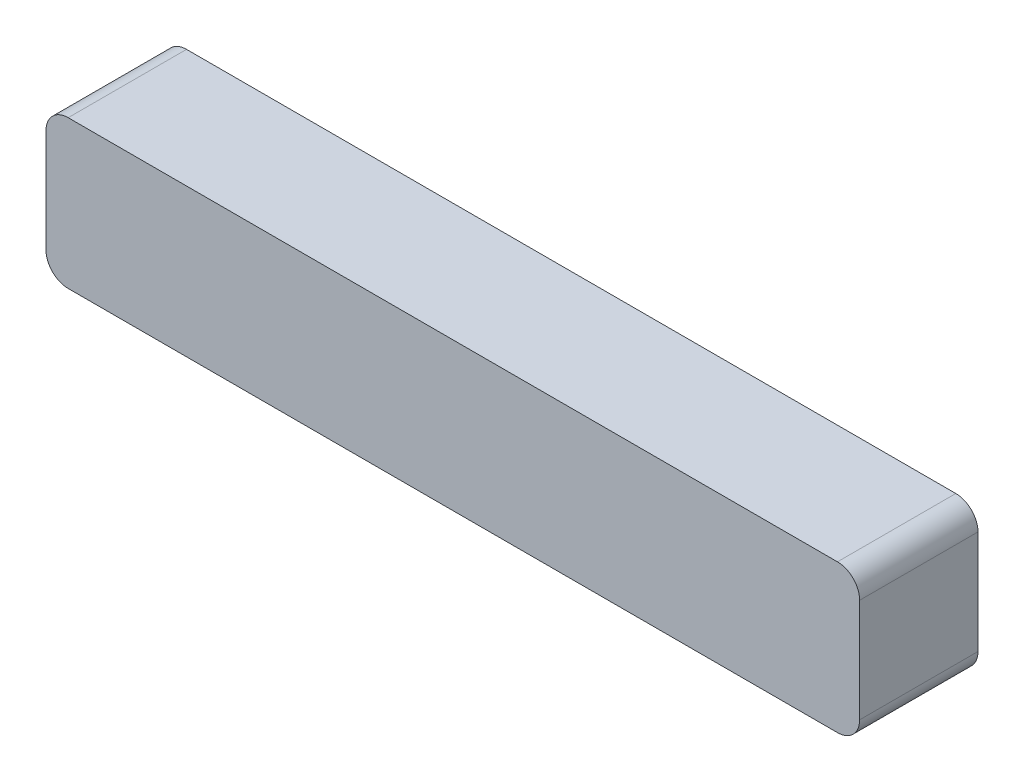
ISO-10303-21;
HEADER;
FILE_DESCRIPTION(('STEP AP214'),'2;1');
FILE_NAME('part.step','',(''),(''),'','','');
FILE_SCHEMA(('AUTOMOTIVE_DESIGN { 1 0 10303 214 1 1 1 1 }'));
ENDSEC;
DATA;
#1=APPLICATION_CONTEXT('core data for automotive mechanical design processes');
#2=APPLICATION_PROTOCOL_DEFINITION('international standard','automotive_design',2000,#1);
#3=PRODUCT_CONTEXT('',#1,'mechanical');
#4=PRODUCT('Part','Part','',(#3));
#5=PRODUCT_RELATED_PRODUCT_CATEGORY('part','',(#4));
#6=PRODUCT_DEFINITION_FORMATION('','',#4);
#7=PRODUCT_DEFINITION_CONTEXT('part definition',#1,'design');
#8=PRODUCT_DEFINITION('design','',#6,#7);
#9=PRODUCT_DEFINITION_SHAPE('','',#8);
#10=(LENGTH_UNIT() NAMED_UNIT(*) SI_UNIT(.MILLI.,.METRE.));
#11=(NAMED_UNIT(*) PLANE_ANGLE_UNIT() SI_UNIT($,.RADIAN.));
#12=(NAMED_UNIT(*) SI_UNIT($,.STERADIAN.) SOLID_ANGLE_UNIT());
#13=UNCERTAINTY_MEASURE_WITH_UNIT(LENGTH_MEASURE(1.E-05),#10,'distance_accuracy_value','');
#14=(GEOMETRIC_REPRESENTATION_CONTEXT(3) GLOBAL_UNCERTAINTY_ASSIGNED_CONTEXT((#13)) GLOBAL_UNIT_ASSIGNED_CONTEXT((#10,
#11,#12)) REPRESENTATION_CONTEXT('',''));
#15=CARTESIAN_POINT('',(0.,0.,0.));
#16=DIRECTION('',(0.,0.,1.));
#17=DIRECTION('',(1.,0.,0.));
#18=AXIS2_PLACEMENT_3D('',#15,#16,#17);
#19=CARTESIAN_POINT('',(107.,3.,16.));
#20=DIRECTION('',(0.,0.,-1.));
#21=DIRECTION('',(-1.,0.,0.));
#22=AXIS2_PLACEMENT_3D('',#19,#20,#21);
#23=CYLINDRICAL_SURFACE('',#22,3.);
#24=CARTESIAN_POINT('',(107.,3.,0.));
#25=DIRECTION('',(0.,0.,1.));
#26=DIRECTION('',(-1.,0.,0.));
#27=AXIS2_PLACEMENT_3D('',#24,#25,#26);
#28=CIRCLE('',#27,3.);
#29=CARTESIAN_POINT('',(107.,0.,0.));
#30=VERTEX_POINT('',#29);
#31=CARTESIAN_POINT('',(110.,3.00000000000002,0.));
#32=VERTEX_POINT('',#31);
#33=EDGE_CURVE('E140',#30,#32,#28,.T.);
#34=ORIENTED_EDGE('',*,*,#33,.T.);
#35=DIRECTION('',(0.,0.,-1.));
#36=VECTOR('',#35,1.);
#37=CARTESIAN_POINT('',(110.,3.00000000000002,16.));
#38=LINE('',#37,#36);
#39=CARTESIAN_POINT('',(110.,3.00000000000002,16.));
#40=VERTEX_POINT('',#39);
#41=EDGE_CURVE('E11',#40,#32,#38,.T.);
#42=ORIENTED_EDGE('',*,*,#41,.F.);
#43=CARTESIAN_POINT('',(107.,3.,16.));
#44=DIRECTION('',(0.,0.,1.));
#45=DIRECTION('',(-1.,0.,0.));
#46=AXIS2_PLACEMENT_3D('',#43,#44,#45);
#47=CIRCLE('',#46,3.);
#48=CARTESIAN_POINT('',(107.,0.,16.));
#49=VERTEX_POINT('',#48);
#50=EDGE_CURVE('E162',#49,#40,#47,.T.);
#51=ORIENTED_EDGE('',*,*,#50,.F.);
#52=DIRECTION('',(0.,0.,-1.));
#53=VECTOR('',#52,1.);
#54=CARTESIAN_POINT('',(107.,0.,16.));
#55=LINE('',#54,#53);
#56=EDGE_CURVE('E136',#49,#30,#55,.T.);
#57=ORIENTED_EDGE('',*,*,#56,.T.);
#58=EDGE_LOOP('',(#34,#42,#51,#57));
#59=FACE_BOUND('',#58,.T.);
#60=ADVANCED_FACE('F39',(#59),#23,.T.);
#61=CARTESIAN_POINT('',(110.,3.00000000000002,16.));
#62=DIRECTION('',(-1.,0.,0.));
#63=DIRECTION('',(0.,0.,1.));
#64=AXIS2_PLACEMENT_3D('',#61,#62,#63);
#65=PLANE('',#64);
#66=DIRECTION('',(0.,1.,0.));
#67=VECTOR('',#66,1.);
#68=CARTESIAN_POINT('',(110.,3.00000000000002,0.));
#69=LINE('',#68,#67);
#70=CARTESIAN_POINT('',(110.,17.,0.));
#71=VERTEX_POINT('',#70);
#72=EDGE_CURVE('E144',#32,#71,#69,.T.);
#73=ORIENTED_EDGE('',*,*,#72,.T.);
#74=DIRECTION('',(0.,0.,-1.));
#75=VECTOR('',#74,1.);
#76=CARTESIAN_POINT('',(110.,17.,16.));
#77=LINE('',#76,#75);
#78=CARTESIAN_POINT('',(110.,17.,16.));
#79=VERTEX_POINT('',#78);
#80=EDGE_CURVE('E48',#79,#71,#77,.T.);
#81=ORIENTED_EDGE('',*,*,#80,.F.);
#82=DIRECTION('',(0.,1.,0.));
#83=VECTOR('',#82,1.);
#84=CARTESIAN_POINT('',(110.,3.00000000000002,16.));
#85=LINE('',#84,#83);
#86=EDGE_CURVE('E99',#40,#79,#85,.T.);
#87=ORIENTED_EDGE('',*,*,#86,.F.);
#88=ORIENTED_EDGE('',*,*,#41,.T.);
#89=EDGE_LOOP('',(#73,#81,#87,#88));
#90=FACE_BOUND('',#89,.T.);
#91=ADVANCED_FACE('F208',(#90),#65,.F.);
#92=CARTESIAN_POINT('',(107.,17.,16.));
#93=DIRECTION('',(0.,0.,-1.));
#94=DIRECTION('',(-1.,0.,0.));
#95=AXIS2_PLACEMENT_3D('',#92,#93,#94);
#96=CYLINDRICAL_SURFACE('',#95,3.);
#97=CARTESIAN_POINT('',(107.,17.,0.));
#98=DIRECTION('',(0.,0.,1.));
#99=DIRECTION('',(1.,0.,0.));
#100=AXIS2_PLACEMENT_3D('',#97,#98,#99);
#101=CIRCLE('',#100,3.);
#102=CARTESIAN_POINT('',(107.,20.,0.));
#103=VERTEX_POINT('',#102);
#104=EDGE_CURVE('E147',#71,#103,#101,.T.);
#105=ORIENTED_EDGE('',*,*,#104,.T.);
#106=DIRECTION('',(0.,0.,-1.));
#107=VECTOR('',#106,1.);
#108=CARTESIAN_POINT('',(107.,20.,16.));
#109=LINE('',#108,#107);
#110=CARTESIAN_POINT('',(107.,20.,16.));
#111=VERTEX_POINT('',#110);
#112=EDGE_CURVE('E173',#111,#103,#109,.T.);
#113=ORIENTED_EDGE('',*,*,#112,.F.);
#114=CARTESIAN_POINT('',(107.,17.,16.));
#115=DIRECTION('',(0.,0.,1.));
#116=DIRECTION('',(1.,0.,0.));
#117=AXIS2_PLACEMENT_3D('',#114,#115,#116);
#118=CIRCLE('',#117,3.);
#119=EDGE_CURVE('E183',#79,#111,#118,.T.);
#120=ORIENTED_EDGE('',*,*,#119,.F.);
#121=ORIENTED_EDGE('',*,*,#80,.T.);
#122=EDGE_LOOP('',(#105,#113,#120,#121));
#123=FACE_BOUND('',#122,.T.);
#124=ADVANCED_FACE('F181',(#123),#96,.T.);
#125=CARTESIAN_POINT('',(3.00000000000002,20.,16.));
#126=DIRECTION('',(0.,-1.,0.));
#127=DIRECTION('',(0.,0.,-1.));
#128=AXIS2_PLACEMENT_3D('',#125,#126,#127);
#129=PLANE('',#128);
#130=DIRECTION('',(-1.,0.,0.));
#131=VECTOR('',#130,1.);
#132=CARTESIAN_POINT('',(3.00000000000002,20.,0.));
#133=LINE('',#132,#131);
#134=CARTESIAN_POINT('',(3.00000000000002,20.,0.));
#135=VERTEX_POINT('',#134);
#136=EDGE_CURVE('E150',#103,#135,#133,.T.);
#137=ORIENTED_EDGE('',*,*,#136,.T.);
#138=DIRECTION('',(0.,0.,-1.));
#139=VECTOR('',#138,1.);
#140=CARTESIAN_POINT('',(3.00000000000002,20.,16.));
#141=LINE('',#140,#139);
#142=CARTESIAN_POINT('',(3.00000000000002,20.,16.));
#143=VERTEX_POINT('',#142);
#144=EDGE_CURVE('E169',#143,#135,#141,.T.);
#145=ORIENTED_EDGE('',*,*,#144,.F.);
#146=DIRECTION('',(-1.,0.,0.));
#147=VECTOR('',#146,1.);
#148=CARTESIAN_POINT('',(3.00000000000002,20.,16.));
#149=LINE('',#148,#147);
#150=EDGE_CURVE('E196',#111,#143,#149,.T.);
#151=ORIENTED_EDGE('',*,*,#150,.F.);
#152=ORIENTED_EDGE('',*,*,#112,.T.);
#153=EDGE_LOOP('',(#137,#145,#151,#152));
#154=FACE_BOUND('',#153,.T.);
#155=ADVANCED_FACE('F191',(#154),#129,.F.);
#156=CARTESIAN_POINT('',(3.,17.,16.));
#157=DIRECTION('',(0.,0.,-1.));
#158=DIRECTION('',(-1.,0.,0.));
#159=AXIS2_PLACEMENT_3D('',#156,#157,#158);
#160=CYLINDRICAL_SURFACE('',#159,3.);
#161=CARTESIAN_POINT('',(3.,17.,0.));
#162=DIRECTION('',(0.,0.,1.));
#163=DIRECTION('',(-1.,0.,0.));
#164=AXIS2_PLACEMENT_3D('',#161,#162,#163);
#165=CIRCLE('',#164,3.);
#166=CARTESIAN_POINT('',(0.,17.,0.));
#167=VERTEX_POINT('',#166);
#168=EDGE_CURVE('E153',#135,#167,#165,.T.);
#169=ORIENTED_EDGE('',*,*,#168,.T.);
#170=DIRECTION('',(0.,0.,-1.));
#171=VECTOR('',#170,1.);
#172=CARTESIAN_POINT('',(0.,17.,16.));
#173=LINE('',#172,#171);
#174=CARTESIAN_POINT('',(0.,17.,16.));
#175=VERTEX_POINT('',#174);
#176=EDGE_CURVE('E129',#175,#167,#173,.T.);
#177=ORIENTED_EDGE('',*,*,#176,.F.);
#178=CARTESIAN_POINT('',(3.,17.,16.));
#179=DIRECTION('',(0.,0.,1.));
#180=DIRECTION('',(-1.,0.,0.));
#181=AXIS2_PLACEMENT_3D('',#178,#179,#180);
#182=CIRCLE('',#181,3.);
#183=EDGE_CURVE('E118',#143,#175,#182,.T.);
#184=ORIENTED_EDGE('',*,*,#183,.F.);
#185=ORIENTED_EDGE('',*,*,#144,.T.);
#186=EDGE_LOOP('',(#169,#177,#184,#185));
#187=FACE_BOUND('',#186,.T.);
#188=ADVANCED_FACE('F194',(#187),#160,.T.);
#189=CARTESIAN_POINT('',(0.,3.00000000000002,16.));
#190=DIRECTION('',(1.,0.,0.));
#191=DIRECTION('',(0.,0.,-1.));
#192=AXIS2_PLACEMENT_3D('',#189,#190,#191);
#193=PLANE('',#192);
#194=DIRECTION('',(0.,-1.,0.));
#195=VECTOR('',#194,1.);
#196=CARTESIAN_POINT('',(0.,3.00000000000002,0.));
#197=LINE('',#196,#195);
#198=CARTESIAN_POINT('',(0.,3.00000000000002,0.));
#199=VERTEX_POINT('',#198);
#200=EDGE_CURVE('E127',#167,#199,#197,.T.);
#201=ORIENTED_EDGE('',*,*,#200,.T.);
#202=DIRECTION('',(0.,0.,-1.));
#203=VECTOR('',#202,1.);
#204=CARTESIAN_POINT('',(0.,3.00000000000002,16.));
#205=LINE('',#204,#203);
#206=CARTESIAN_POINT('',(0.,3.00000000000002,16.));
#207=VERTEX_POINT('',#206);
#208=EDGE_CURVE('E124',#207,#199,#205,.T.);
#209=ORIENTED_EDGE('',*,*,#208,.F.);
#210=DIRECTION('',(0.,-1.,0.));
#211=VECTOR('',#210,1.);
#212=CARTESIAN_POINT('',(0.,3.00000000000002,16.));
#213=LINE('',#212,#211);
#214=EDGE_CURVE('E112',#175,#207,#213,.T.);
#215=ORIENTED_EDGE('',*,*,#214,.F.);
#216=ORIENTED_EDGE('',*,*,#176,.T.);
#217=EDGE_LOOP('',(#201,#209,#215,#216));
#218=FACE_BOUND('',#217,.T.);
#219=ADVANCED_FACE('F125',(#218),#193,.F.);
#220=CARTESIAN_POINT('',(3.,3.,16.));
#221=DIRECTION('',(0.,0.,-1.));
#222=DIRECTION('',(-1.,0.,0.));
#223=AXIS2_PLACEMENT_3D('',#220,#221,#222);
#224=CYLINDRICAL_SURFACE('',#223,3.);
#225=CARTESIAN_POINT('',(3.,3.,0.));
#226=DIRECTION('',(0.,0.,1.));
#227=DIRECTION('',(1.,0.,0.));
#228=AXIS2_PLACEMENT_3D('',#225,#226,#227);
#229=CIRCLE('',#228,3.);
#230=CARTESIAN_POINT('',(3.00000000000002,0.,0.));
#231=VERTEX_POINT('',#230);
#232=EDGE_CURVE('E85',#199,#231,#229,.T.);
#233=ORIENTED_EDGE('',*,*,#232,.T.);
#234=DIRECTION('',(0.,0.,-1.));
#235=VECTOR('',#234,1.);
#236=CARTESIAN_POINT('',(3.00000000000002,0.,16.));
#237=LINE('',#236,#235);
#238=CARTESIAN_POINT('',(3.00000000000002,0.,16.));
#239=VERTEX_POINT('',#238);
#240=EDGE_CURVE('E130',#239,#231,#237,.T.);
#241=ORIENTED_EDGE('',*,*,#240,.F.);
#242=CARTESIAN_POINT('',(3.,3.,16.));
#243=DIRECTION('',(0.,0.,1.));
#244=DIRECTION('',(1.,0.,0.));
#245=AXIS2_PLACEMENT_3D('',#242,#243,#244);
#246=CIRCLE('',#245,3.);
#247=EDGE_CURVE('E116',#207,#239,#246,.T.);
#248=ORIENTED_EDGE('',*,*,#247,.F.);
#249=ORIENTED_EDGE('',*,*,#208,.T.);
#250=EDGE_LOOP('',(#233,#241,#248,#249));
#251=FACE_BOUND('',#250,.T.);
#252=ADVANCED_FACE('F132',(#251),#224,.T.);
#253=CARTESIAN_POINT('',(3.00000000000002,0.,16.));
#254=DIRECTION('',(0.,1.,0.));
#255=DIRECTION('',(0.,0.,1.));
#256=AXIS2_PLACEMENT_3D('',#253,#254,#255);
#257=PLANE('',#256);
#258=DIRECTION('',(1.,0.,0.));
#259=VECTOR('',#258,1.);
#260=CARTESIAN_POINT('',(3.00000000000002,0.,0.));
#261=LINE('',#260,#259);
#262=EDGE_CURVE('E91',#231,#30,#261,.T.);
#263=ORIENTED_EDGE('',*,*,#262,.T.);
#264=ORIENTED_EDGE('',*,*,#56,.F.);
#265=DIRECTION('',(1.,0.,0.));
#266=VECTOR('',#265,1.);
#267=CARTESIAN_POINT('',(3.00000000000002,0.,16.));
#268=LINE('',#267,#266);
#269=EDGE_CURVE('E56',#239,#49,#268,.T.);
#270=ORIENTED_EDGE('',*,*,#269,.F.);
#271=ORIENTED_EDGE('',*,*,#240,.T.);
#272=EDGE_LOOP('',(#263,#264,#270,#271));
#273=FACE_BOUND('',#272,.T.);
#274=ADVANCED_FACE('F224',(#273),#257,.F.);
#275=CARTESIAN_POINT('',(107.,3.,16.));
#276=DIRECTION('',(0.,0.,-1.));
#277=DIRECTION('',(-1.,0.,0.));
#278=AXIS2_PLACEMENT_3D('',#275,#276,#277);
#279=PLANE('',#278);
#280=ORIENTED_EDGE('',*,*,#50,.T.);
#281=ORIENTED_EDGE('',*,*,#86,.T.);
#282=ORIENTED_EDGE('',*,*,#119,.T.);
#283=ORIENTED_EDGE('',*,*,#150,.T.);
#284=ORIENTED_EDGE('',*,*,#183,.T.);
#285=ORIENTED_EDGE('',*,*,#214,.T.);
#286=ORIENTED_EDGE('',*,*,#247,.T.);
#287=ORIENTED_EDGE('',*,*,#269,.T.);
#288=EDGE_LOOP('',(#280,#281,#282,#283,#284,#285,#286,#287));
#289=FACE_BOUND('',#288,.T.);
#290=ADVANCED_FACE('F114',(#289),#279,.F.);
#291=CARTESIAN_POINT('',(107.,3.,0.));
#292=DIRECTION('',(0.,0.,-1.));
#293=DIRECTION('',(-1.,0.,0.));
#294=AXIS2_PLACEMENT_3D('',#291,#292,#293);
#295=PLANE('',#294);
#296=ORIENTED_EDGE('',*,*,#33,.F.);
#297=ORIENTED_EDGE('',*,*,#262,.F.);
#298=ORIENTED_EDGE('',*,*,#232,.F.);
#299=ORIENTED_EDGE('',*,*,#200,.F.);
#300=ORIENTED_EDGE('',*,*,#168,.F.);
#301=ORIENTED_EDGE('',*,*,#136,.F.);
#302=ORIENTED_EDGE('',*,*,#104,.F.);
#303=ORIENTED_EDGE('',*,*,#72,.F.);
#304=EDGE_LOOP('',(#296,#297,#298,#299,#300,#301,#302,#303));
#305=FACE_BOUND('',#304,.T.);
#306=ADVANCED_FACE('F187',(#305),#295,.T.);
#307=CLOSED_SHELL('',(#60,#91,#124,#155,#188,#219,#252,#274,#290,#306));
#308=MANIFOLD_SOLID_BREP('B2',#307);
#309=ADVANCED_BREP_SHAPE_REPRESENTATION('',(#18,#308),#14);
#310=SHAPE_DEFINITION_REPRESENTATION(#9,#309);
ENDSEC;
END-ISO-10303-21;
